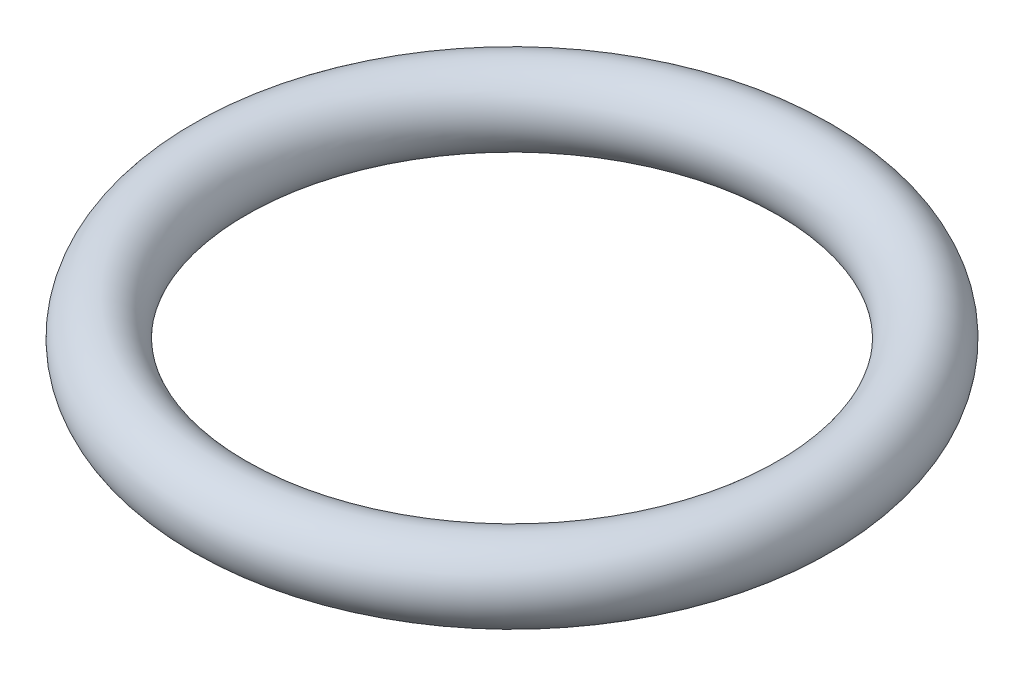
ISO-10303-21;
HEADER;
FILE_DESCRIPTION(('STEP AP214'),'2;1');
FILE_NAME('part.step','',(''),(''),'','','');
FILE_SCHEMA(('AUTOMOTIVE_DESIGN { 1 0 10303 214 1 1 1 1 }'));
ENDSEC;
DATA;
#1=APPLICATION_CONTEXT('core data for automotive mechanical design processes');
#2=APPLICATION_PROTOCOL_DEFINITION('international standard','automotive_design',2000,#1);
#3=PRODUCT_CONTEXT('',#1,'mechanical');
#4=PRODUCT('Part','Part','',(#3));
#5=PRODUCT_RELATED_PRODUCT_CATEGORY('part','',(#4));
#6=PRODUCT_DEFINITION_FORMATION('','',#4);
#7=PRODUCT_DEFINITION_CONTEXT('part definition',#1,'design');
#8=PRODUCT_DEFINITION('design','',#6,#7);
#9=PRODUCT_DEFINITION_SHAPE('','',#8);
#10=(LENGTH_UNIT() NAMED_UNIT(*) SI_UNIT(.MILLI.,.METRE.));
#11=(NAMED_UNIT(*) PLANE_ANGLE_UNIT() SI_UNIT($,.RADIAN.));
#12=(NAMED_UNIT(*) SI_UNIT($,.STERADIAN.) SOLID_ANGLE_UNIT());
#13=UNCERTAINTY_MEASURE_WITH_UNIT(LENGTH_MEASURE(1.E-05),#10,'distance_accuracy_value','');
#14=(GEOMETRIC_REPRESENTATION_CONTEXT(3) GLOBAL_UNCERTAINTY_ASSIGNED_CONTEXT((#13)) GLOBAL_UNIT_ASSIGNED_CONTEXT((#10,
#11,#12)) REPRESENTATION_CONTEXT('',''));
#15=CARTESIAN_POINT('',(0.,0.,0.));
#16=DIRECTION('',(0.,0.,1.));
#17=DIRECTION('',(1.,0.,0.));
#18=AXIS2_PLACEMENT_3D('',#15,#16,#17);
#19=CARTESIAN_POINT('',(0.,0.,0.));
#20=DIRECTION('',(0.,1.,0.));
#21=DIRECTION('',(0.,0.,1.));
#22=AXIS2_PLACEMENT_3D('',#19,#20,#21);
#23=TOROIDAL_SURFACE('',#22,11.75,1.5);
#24=CARTESIAN_POINT('',(0.,0.,-11.75));
#25=DIRECTION('',(1.,0.,0.));
#26=DIRECTION('',(0.,0.,-1.));
#27=AXIS2_PLACEMENT_3D('',#24,#25,#26);
#28=CIRCLE('',#27,1.5);
#29=CARTESIAN_POINT('',(0.,0.,-13.25));
#30=VERTEX_POINT('',#29);
#31=EDGE_CURVE('E10',#30,#30,#28,.T.);
#32=CARTESIAN_POINT('',(0.,0.,0.));
#33=DIRECTION('',(0.,1.,0.));
#34=DIRECTION('',(0.,0.,1.));
#35=AXIS2_PLACEMENT_3D('',#32,#33,#34);
#36=CIRCLE('',#35,13.25);
#37=EDGE_CURVE('',#30,#30,#36,.T.);
#38=ORIENTED_EDGE('',*,*,#31,.F.);
#39=ORIENTED_EDGE('',*,*,#31,.T.);
#40=ORIENTED_EDGE('',*,*,#37,.T.);
#41=ORIENTED_EDGE('',*,*,#37,.F.);
#42=EDGE_LOOP('',(#38,#40,#39,#41));
#43=FACE_BOUND('',#42,.T.);
#44=ADVANCED_FACE('F32',(#43),#23,.T.);
#45=CLOSED_SHELL('',(#44));
#46=MANIFOLD_SOLID_BREP('B2',#45);
#47=ADVANCED_BREP_SHAPE_REPRESENTATION('',(#18,#46),#14);
#48=SHAPE_DEFINITION_REPRESENTATION(#9,#47);
ENDSEC;
END-ISO-10303-21;
